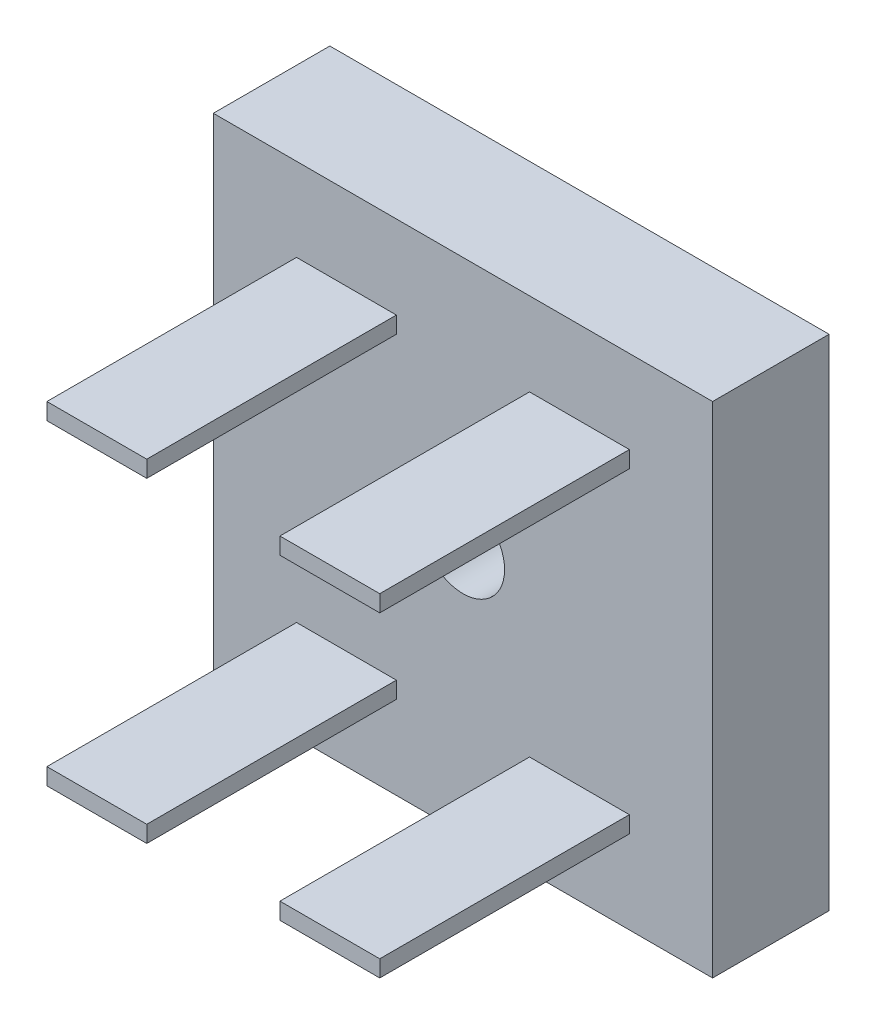
ISO-10303-21;
HEADER;
FILE_DESCRIPTION(('STEP AP214'),'2;1');
FILE_NAME('part.step','',(''),(''),'','','');
FILE_SCHEMA(('AUTOMOTIVE_DESIGN { 1 0 10303 214 1 1 1 1 }'));
ENDSEC;
DATA;
#1=APPLICATION_CONTEXT('core data for automotive mechanical design processes');
#2=APPLICATION_PROTOCOL_DEFINITION('international standard','automotive_design',2000,#1);
#3=PRODUCT_CONTEXT('',#1,'mechanical');
#4=PRODUCT('Part','Part','',(#3));
#5=PRODUCT_RELATED_PRODUCT_CATEGORY('part','',(#4));
#6=PRODUCT_DEFINITION_FORMATION('','',#4);
#7=PRODUCT_DEFINITION_CONTEXT('part definition',#1,'design');
#8=PRODUCT_DEFINITION('design','',#6,#7);
#9=PRODUCT_DEFINITION_SHAPE('','',#8);
#10=(LENGTH_UNIT() NAMED_UNIT(*) SI_UNIT(.MILLI.,.METRE.));
#11=(NAMED_UNIT(*) PLANE_ANGLE_UNIT() SI_UNIT($,.RADIAN.));
#12=(NAMED_UNIT(*) SI_UNIT($,.STERADIAN.) SOLID_ANGLE_UNIT());
#13=UNCERTAINTY_MEASURE_WITH_UNIT(LENGTH_MEASURE(1.E-05),#10,'distance_accuracy_value','');
#14=(GEOMETRIC_REPRESENTATION_CONTEXT(3) GLOBAL_UNCERTAINTY_ASSIGNED_CONTEXT((#13)) GLOBAL_UNIT_ASSIGNED_CONTEXT((#10,
#11,#12)) REPRESENTATION_CONTEXT('',''));
#15=CARTESIAN_POINT('',(0.,0.,0.));
#16=DIRECTION('',(0.,0.,1.));
#17=DIRECTION('',(1.,0.,0.));
#18=AXIS2_PLACEMENT_3D('',#15,#16,#17);
#19=CARTESIAN_POINT('',(0.,0.,7.));
#20=DIRECTION('',(0.,0.,1.));
#21=DIRECTION('',(1.,0.,0.));
#22=AXIS2_PLACEMENT_3D('',#19,#20,#21);
#23=PLANE('',#22);
#24=DIRECTION('',(0.,-1.,0.));
#25=VECTOR('',#24,1.);
#26=CARTESIAN_POINT('',(-3.21995192307692,2.7172131147541,7.));
#27=LINE('',#26,#25);
#28=CARTESIAN_POINT('',(-3.21995192307692,2.7172131147541,7.));
#29=VERTEX_POINT('',#28);
#30=CARTESIAN_POINT('',(-3.21995192307692,-27.2827868852459,7.));
#31=VERTEX_POINT('',#30);
#32=EDGE_CURVE('E292',#29,#31,#27,.T.);
#33=ORIENTED_EDGE('',*,*,#32,.T.);
#34=DIRECTION('',(1.,0.,0.));
#35=VECTOR('',#34,1.);
#36=CARTESIAN_POINT('',(-3.21995192307692,-27.2827868852459,7.));
#37=LINE('',#36,#35);
#38=CARTESIAN_POINT('',(26.7800480769231,-27.2827868852459,7.));
#39=VERTEX_POINT('',#38);
#40=EDGE_CURVE('E295',#31,#39,#37,.T.);
#41=ORIENTED_EDGE('',*,*,#40,.T.);
#42=DIRECTION('',(0.,1.,0.));
#43=VECTOR('',#42,1.);
#44=CARTESIAN_POINT('',(26.7800480769231,2.7172131147541,7.));
#45=LINE('',#44,#43);
#46=CARTESIAN_POINT('',(26.7800480769231,2.7172131147541,7.));
#47=VERTEX_POINT('',#46);
#48=EDGE_CURVE('E298',#39,#47,#45,.T.);
#49=ORIENTED_EDGE('',*,*,#48,.T.);
#50=DIRECTION('',(-1.,0.,0.));
#51=VECTOR('',#50,1.);
#52=CARTESIAN_POINT('',(-3.21995192307692,2.7172131147541,7.));
#53=LINE('',#52,#51);
#54=EDGE_CURVE('E300',#47,#29,#53,.T.);
#55=ORIENTED_EDGE('',*,*,#54,.T.);
#56=EDGE_LOOP('',(#33,#41,#49,#55));
#57=FACE_BOUND('',#56,.T.);
#58=CARTESIAN_POINT('',(11.7800480769231,-12.2827868852459,7.));
#59=DIRECTION('',(0.,0.,1.));
#60=DIRECTION('',(1.,0.,0.));
#61=AXIS2_PLACEMENT_3D('',#58,#59,#60);
#62=CIRCLE('',#61,2.5);
#63=CARTESIAN_POINT('',(14.2800480769231,-12.2827868852459,7.));
#64=VERTEX_POINT('',#63);
#65=EDGE_CURVE('E286',#64,#64,#62,.T.);
#66=ORIENTED_EDGE('',*,*,#65,.F.);
#67=EDGE_LOOP('',(#66));
#68=FACE_BOUND('',#67,.T.);
#69=DIRECTION('',(1.,0.,0.));
#70=VECTOR('',#69,1.);
#71=CARTESIAN_POINT('',(1.78004807692308,-3.2827868852459,7.));
#72=LINE('',#71,#70);
#73=CARTESIAN_POINT('',(1.78004807692308,-3.2827868852459,7.));
#74=VERTEX_POINT('',#73);
#75=CARTESIAN_POINT('',(7.78004807692308,-3.2827868852459,7.));
#76=VERTEX_POINT('',#75);
#77=EDGE_CURVE('E270',#74,#76,#72,.T.);
#78=ORIENTED_EDGE('',*,*,#77,.F.);
#79=DIRECTION('',(0.,-1.,0.));
#80=VECTOR('',#79,1.);
#81=CARTESIAN_POINT('',(1.78004807692308,-2.2827868852459,7.));
#82=LINE('',#81,#80);
#83=CARTESIAN_POINT('',(1.78004807692308,-2.2827868852459,7.));
#84=VERTEX_POINT('',#83);
#85=EDGE_CURVE('E256',#84,#74,#82,.T.);
#86=ORIENTED_EDGE('',*,*,#85,.F.);
#87=DIRECTION('',(-1.,0.,0.));
#88=VECTOR('',#87,1.);
#89=CARTESIAN_POINT('',(1.78004807692308,-2.2827868852459,7.));
#90=LINE('',#89,#88);
#91=CARTESIAN_POINT('',(7.78004807692308,-2.2827868852459,7.));
#92=VERTEX_POINT('',#91);
#93=EDGE_CURVE('E261',#92,#84,#90,.T.);
#94=ORIENTED_EDGE('',*,*,#93,.F.);
#95=DIRECTION('',(0.,1.,0.));
#96=VECTOR('',#95,1.);
#97=CARTESIAN_POINT('',(7.78004807692308,-2.2827868852459,7.));
#98=LINE('',#97,#96);
#99=EDGE_CURVE('E272',#76,#92,#98,.T.);
#100=ORIENTED_EDGE('',*,*,#99,.F.);
#101=EDGE_LOOP('',(#78,#86,#94,#100));
#102=FACE_BOUND('',#101,.T.);
#103=DIRECTION('',(1.,0.,0.));
#104=VECTOR('',#103,1.);
#105=CARTESIAN_POINT('',(15.7800480769231,-3.2827868852459,7.));
#106=LINE('',#105,#104);
#107=CARTESIAN_POINT('',(15.7800480769231,-3.2827868852459,7.));
#108=VERTEX_POINT('',#107);
#109=CARTESIAN_POINT('',(21.7800480769231,-3.2827868852459,7.));
#110=VERTEX_POINT('',#109);
#111=EDGE_CURVE('E241',#108,#110,#106,.T.);
#112=ORIENTED_EDGE('',*,*,#111,.F.);
#113=DIRECTION('',(0.,-1.,0.));
#114=VECTOR('',#113,1.);
#115=CARTESIAN_POINT('',(15.7800480769231,-2.2827868852459,7.));
#116=LINE('',#115,#114);
#117=CARTESIAN_POINT('',(15.7800480769231,-2.2827868852459,7.));
#118=VERTEX_POINT('',#117);
#119=EDGE_CURVE('E227',#118,#108,#116,.T.);
#120=ORIENTED_EDGE('',*,*,#119,.F.);
#121=DIRECTION('',(-1.,0.,0.));
#122=VECTOR('',#121,1.);
#123=CARTESIAN_POINT('',(15.7800480769231,-2.2827868852459,7.));
#124=LINE('',#123,#122);
#125=CARTESIAN_POINT('',(21.7800480769231,-2.2827868852459,7.));
#126=VERTEX_POINT('',#125);
#127=EDGE_CURVE('E232',#126,#118,#124,.T.);
#128=ORIENTED_EDGE('',*,*,#127,.F.);
#129=DIRECTION('',(0.,1.,0.));
#130=VECTOR('',#129,1.);
#131=CARTESIAN_POINT('',(21.7800480769231,-2.2827868852459,7.));
#132=LINE('',#131,#130);
#133=EDGE_CURVE('E243',#110,#126,#132,.T.);
#134=ORIENTED_EDGE('',*,*,#133,.F.);
#135=EDGE_LOOP('',(#112,#120,#128,#134));
#136=FACE_BOUND('',#135,.T.);
#137=DIRECTION('',(1.,0.,0.));
#138=VECTOR('',#137,1.);
#139=CARTESIAN_POINT('',(1.78004807692308,-22.2827868852459,7.));
#140=LINE('',#139,#138);
#141=CARTESIAN_POINT('',(1.78004807692308,-22.2827868852459,7.));
#142=VERTEX_POINT('',#141);
#143=CARTESIAN_POINT('',(7.78004807692308,-22.2827868852459,7.));
#144=VERTEX_POINT('',#143);
#145=EDGE_CURVE('E199',#142,#144,#140,.T.);
#146=ORIENTED_EDGE('',*,*,#145,.F.);
#147=DIRECTION('',(0.,-1.,0.));
#148=VECTOR('',#147,1.);
#149=CARTESIAN_POINT('',(1.78004807692308,-21.2827868852459,7.));
#150=LINE('',#149,#148);
#151=CARTESIAN_POINT('',(1.78004807692308,-21.2827868852459,7.));
#152=VERTEX_POINT('',#151);
#153=EDGE_CURVE('E196',#152,#142,#150,.T.);
#154=ORIENTED_EDGE('',*,*,#153,.F.);
#155=DIRECTION('',(-1.,0.,0.));
#156=VECTOR('',#155,1.);
#157=CARTESIAN_POINT('',(1.78004807692308,-21.2827868852459,7.));
#158=LINE('',#157,#156);
#159=CARTESIAN_POINT('',(7.78004807692308,-21.2827868852459,7.));
#160=VERTEX_POINT('',#159);
#161=EDGE_CURVE('E208',#160,#152,#158,.T.);
#162=ORIENTED_EDGE('',*,*,#161,.F.);
#163=DIRECTION('',(0.,1.,0.));
#164=VECTOR('',#163,1.);
#165=CARTESIAN_POINT('',(7.78004807692308,-21.2827868852459,7.));
#166=LINE('',#165,#164);
#167=EDGE_CURVE('E216',#144,#160,#166,.T.);
#168=ORIENTED_EDGE('',*,*,#167,.F.);
#169=EDGE_LOOP('',(#146,#154,#162,#168));
#170=FACE_BOUND('',#169,.T.);
#171=DIRECTION('',(1.,0.,0.));
#172=VECTOR('',#171,1.);
#173=CARTESIAN_POINT('',(15.7800480769231,-22.2827868852459,7.));
#174=LINE('',#173,#172);
#175=CARTESIAN_POINT('',(15.7800480769231,-22.2827868852459,7.));
#176=VERTEX_POINT('',#175);
#177=CARTESIAN_POINT('',(21.7800480769231,-22.2827868852459,7.));
#178=VERTEX_POINT('',#177);
#179=EDGE_CURVE('E381',#176,#178,#174,.T.);
#180=ORIENTED_EDGE('',*,*,#179,.F.);
#181=DIRECTION('',(0.,-1.,0.));
#182=VECTOR('',#181,1.);
#183=CARTESIAN_POINT('',(15.7800480769231,-21.2827868852459,7.));
#184=LINE('',#183,#182);
#185=CARTESIAN_POINT('',(15.7800480769231,-21.2827868852459,7.));
#186=VERTEX_POINT('',#185);
#187=EDGE_CURVE('E194',#186,#176,#184,.T.);
#188=ORIENTED_EDGE('',*,*,#187,.F.);
#189=DIRECTION('',(-1.,0.,0.));
#190=VECTOR('',#189,1.);
#191=CARTESIAN_POINT('',(15.7800480769231,-21.2827868852459,7.));
#192=LINE('',#191,#190);
#193=CARTESIAN_POINT('',(21.7800480769231,-21.2827868852459,7.));
#194=VERTEX_POINT('',#193);
#195=EDGE_CURVE('E190',#194,#186,#192,.T.);
#196=ORIENTED_EDGE('',*,*,#195,.F.);
#197=DIRECTION('',(0.,1.,0.));
#198=VECTOR('',#197,1.);
#199=CARTESIAN_POINT('',(21.7800480769231,-21.2827868852459,7.));
#200=LINE('',#199,#198);
#201=EDGE_CURVE('E383',#178,#194,#200,.T.);
#202=ORIENTED_EDGE('',*,*,#201,.F.);
#203=EDGE_LOOP('',(#180,#188,#196,#202));
#204=FACE_BOUND('',#203,.T.);
#205=ADVANCED_FACE('F33',(#57,#68,#102,#136,#170,#204),#23,.T.);
#206=CARTESIAN_POINT('',(0.,0.,0.));
#207=DIRECTION('',(0.,0.,1.));
#208=DIRECTION('',(1.,0.,0.));
#209=AXIS2_PLACEMENT_3D('',#206,#207,#208);
#210=PLANE('',#209);
#211=DIRECTION('',(0.,-1.,0.));
#212=VECTOR('',#211,1.);
#213=CARTESIAN_POINT('',(-3.21995192307692,2.7172131147541,0.));
#214=LINE('',#213,#212);
#215=CARTESIAN_POINT('',(-3.21995192307692,2.7172131147541,0.));
#216=VERTEX_POINT('',#215);
#217=CARTESIAN_POINT('',(-3.21995192307692,-27.2827868852459,0.));
#218=VERTEX_POINT('',#217);
#219=EDGE_CURVE('E289',#216,#218,#214,.T.);
#220=ORIENTED_EDGE('',*,*,#219,.F.);
#221=DIRECTION('',(-1.,0.,0.));
#222=VECTOR('',#221,1.);
#223=CARTESIAN_POINT('',(-3.21995192307692,2.7172131147541,0.));
#224=LINE('',#223,#222);
#225=CARTESIAN_POINT('',(26.7800480769231,2.7172131147541,0.));
#226=VERTEX_POINT('',#225);
#227=EDGE_CURVE('E296',#226,#216,#224,.T.);
#228=ORIENTED_EDGE('',*,*,#227,.F.);
#229=DIRECTION('',(0.,1.,0.));
#230=VECTOR('',#229,1.);
#231=CARTESIAN_POINT('',(26.7800480769231,2.7172131147541,0.));
#232=LINE('',#231,#230);
#233=CARTESIAN_POINT('',(26.7800480769231,-27.2827868852459,0.));
#234=VERTEX_POINT('',#233);
#235=EDGE_CURVE('E307',#234,#226,#232,.T.);
#236=ORIENTED_EDGE('',*,*,#235,.F.);
#237=DIRECTION('',(1.,0.,0.));
#238=VECTOR('',#237,1.);
#239=CARTESIAN_POINT('',(-3.21995192307692,-27.2827868852459,0.));
#240=LINE('',#239,#238);
#241=EDGE_CURVE('E305',#218,#234,#240,.T.);
#242=ORIENTED_EDGE('',*,*,#241,.F.);
#243=EDGE_LOOP('',(#220,#228,#236,#242));
#244=FACE_BOUND('',#243,.T.);
#245=CARTESIAN_POINT('',(11.7800480769231,-12.2827868852459,0.));
#246=DIRECTION('',(0.,0.,1.));
#247=DIRECTION('',(1.,0.,0.));
#248=AXIS2_PLACEMENT_3D('',#245,#246,#247);
#249=CIRCLE('',#248,2.5);
#250=CARTESIAN_POINT('',(14.2800480769231,-12.2827868852459,0.));
#251=VERTEX_POINT('',#250);
#252=EDGE_CURVE('E285',#251,#251,#249,.T.);
#253=ORIENTED_EDGE('',*,*,#252,.T.);
#254=EDGE_LOOP('',(#253));
#255=FACE_BOUND('',#254,.T.);
#256=ADVANCED_FACE('F325',(#244,#255),#210,.F.);
#257=CARTESIAN_POINT('',(-3.21995192307692,2.7172131147541,7.));
#258=DIRECTION('',(1.,0.,0.));
#259=DIRECTION('',(0.,1.,0.));
#260=AXIS2_PLACEMENT_3D('',#257,#258,#259);
#261=PLANE('',#260);
#262=ORIENTED_EDGE('',*,*,#219,.T.);
#263=DIRECTION('',(0.,0.,-1.));
#264=VECTOR('',#263,1.);
#265=CARTESIAN_POINT('',(-3.21995192307692,-27.2827868852459,7.));
#266=LINE('',#265,#264);
#267=EDGE_CURVE('E11',#31,#218,#266,.T.);
#268=ORIENTED_EDGE('',*,*,#267,.F.);
#269=ORIENTED_EDGE('',*,*,#32,.F.);
#270=DIRECTION('',(0.,0.,-1.));
#271=VECTOR('',#270,1.);
#272=CARTESIAN_POINT('',(-3.21995192307692,2.7172131147541,7.));
#273=LINE('',#272,#271);
#274=EDGE_CURVE('E302',#29,#216,#273,.T.);
#275=ORIENTED_EDGE('',*,*,#274,.T.);
#276=EDGE_LOOP('',(#262,#268,#269,#275));
#277=FACE_BOUND('',#276,.T.);
#278=ADVANCED_FACE('F35',(#277),#261,.F.);
#279=CARTESIAN_POINT('',(-3.21995192307692,-27.2827868852459,7.));
#280=DIRECTION('',(0.,1.,0.));
#281=DIRECTION('',(0.,0.,1.));
#282=AXIS2_PLACEMENT_3D('',#279,#280,#281);
#283=PLANE('',#282);
#284=ORIENTED_EDGE('',*,*,#241,.T.);
#285=DIRECTION('',(0.,0.,-1.));
#286=VECTOR('',#285,1.);
#287=CARTESIAN_POINT('',(26.7800480769231,-27.2827868852459,7.));
#288=LINE('',#287,#286);
#289=EDGE_CURVE('E41',#39,#234,#288,.T.);
#290=ORIENTED_EDGE('',*,*,#289,.F.);
#291=ORIENTED_EDGE('',*,*,#40,.F.);
#292=ORIENTED_EDGE('',*,*,#267,.T.);
#293=EDGE_LOOP('',(#284,#290,#291,#292));
#294=FACE_BOUND('',#293,.T.);
#295=ADVANCED_FACE('F336',(#294),#283,.F.);
#296=CARTESIAN_POINT('',(26.7800480769231,2.7172131147541,7.));
#297=DIRECTION('',(-1.,0.,0.));
#298=DIRECTION('',(0.,-1.,0.));
#299=AXIS2_PLACEMENT_3D('',#296,#297,#298);
#300=PLANE('',#299);
#301=ORIENTED_EDGE('',*,*,#235,.T.);
#302=DIRECTION('',(0.,0.,-1.));
#303=VECTOR('',#302,1.);
#304=CARTESIAN_POINT('',(26.7800480769231,2.7172131147541,7.));
#305=LINE('',#304,#303);
#306=EDGE_CURVE('E312',#47,#226,#305,.T.);
#307=ORIENTED_EDGE('',*,*,#306,.F.);
#308=ORIENTED_EDGE('',*,*,#48,.F.);
#309=ORIENTED_EDGE('',*,*,#289,.T.);
#310=EDGE_LOOP('',(#301,#307,#308,#309));
#311=FACE_BOUND('',#310,.T.);
#312=ADVANCED_FACE('F319',(#311),#300,.F.);
#313=CARTESIAN_POINT('',(-3.21995192307692,2.7172131147541,7.));
#314=DIRECTION('',(0.,-1.,0.));
#315=DIRECTION('',(0.,0.,-1.));
#316=AXIS2_PLACEMENT_3D('',#313,#314,#315);
#317=PLANE('',#316);
#318=ORIENTED_EDGE('',*,*,#227,.T.);
#319=ORIENTED_EDGE('',*,*,#274,.F.);
#320=ORIENTED_EDGE('',*,*,#54,.F.);
#321=ORIENTED_EDGE('',*,*,#306,.T.);
#322=EDGE_LOOP('',(#318,#319,#320,#321));
#323=FACE_BOUND('',#322,.T.);
#324=ADVANCED_FACE('F329',(#323),#317,.F.);
#325=CARTESIAN_POINT('',(11.7800480769231,-12.2827868852459,7.));
#326=DIRECTION('',(0.,0.,-1.));
#327=DIRECTION('',(-1.,0.,0.));
#328=AXIS2_PLACEMENT_3D('',#325,#326,#327);
#329=CYLINDRICAL_SURFACE('',#328,2.5);
#330=ORIENTED_EDGE('',*,*,#65,.T.);
#331=EDGE_LOOP('',(#330));
#332=FACE_BOUND('',#331,.T.);
#333=ORIENTED_EDGE('',*,*,#252,.F.);
#334=EDGE_LOOP('',(#333));
#335=FACE_BOUND('',#334,.T.);
#336=ADVANCED_FACE('F350',(#332,#335),#329,.F.);
#337=CARTESIAN_POINT('',(1.78004807692308,-2.2827868852459,22.));
#338=DIRECTION('',(1.,0.,0.));
#339=DIRECTION('',(0.,1.,0.));
#340=AXIS2_PLACEMENT_3D('',#337,#338,#339);
#341=PLANE('',#340);
#342=ORIENTED_EDGE('',*,*,#85,.T.);
#343=DIRECTION('',(0.,0.,-1.));
#344=VECTOR('',#343,1.);
#345=CARTESIAN_POINT('',(1.78004807692308,-3.2827868852459,22.));
#346=LINE('',#345,#344);
#347=CARTESIAN_POINT('',(1.78004807692308,-3.2827868852459,22.));
#348=VERTEX_POINT('',#347);
#349=EDGE_CURVE('E283',#348,#74,#346,.T.);
#350=ORIENTED_EDGE('',*,*,#349,.F.);
#351=DIRECTION('',(0.,-1.,0.));
#352=VECTOR('',#351,1.);
#353=CARTESIAN_POINT('',(1.78004807692308,-2.2827868852459,22.));
#354=LINE('',#353,#352);
#355=CARTESIAN_POINT('',(1.78004807692308,-2.2827868852459,22.));
#356=VERTEX_POINT('',#355);
#357=EDGE_CURVE('E257',#356,#348,#354,.T.);
#358=ORIENTED_EDGE('',*,*,#357,.F.);
#359=DIRECTION('',(0.,0.,-1.));
#360=VECTOR('',#359,1.);
#361=CARTESIAN_POINT('',(1.78004807692308,-2.2827868852459,22.));
#362=LINE('',#361,#360);
#363=EDGE_CURVE('E267',#356,#84,#362,.T.);
#364=ORIENTED_EDGE('',*,*,#363,.T.);
#365=EDGE_LOOP('',(#342,#350,#358,#364));
#366=FACE_BOUND('',#365,.T.);
#367=ADVANCED_FACE('F357',(#366),#341,.F.);
#368=CARTESIAN_POINT('',(1.78004807692308,-3.2827868852459,22.));
#369=DIRECTION('',(0.,1.,0.));
#370=DIRECTION('',(0.,0.,1.));
#371=AXIS2_PLACEMENT_3D('',#368,#369,#370);
#372=PLANE('',#371);
#373=ORIENTED_EDGE('',*,*,#77,.T.);
#374=DIRECTION('',(0.,0.,-1.));
#375=VECTOR('',#374,1.);
#376=CARTESIAN_POINT('',(7.78004807692308,-3.2827868852459,22.));
#377=LINE('',#376,#375);
#378=CARTESIAN_POINT('',(7.78004807692308,-3.2827868852459,22.));
#379=VERTEX_POINT('',#378);
#380=EDGE_CURVE('E280',#379,#76,#377,.T.);
#381=ORIENTED_EDGE('',*,*,#380,.F.);
#382=DIRECTION('',(1.,0.,0.));
#383=VECTOR('',#382,1.);
#384=CARTESIAN_POINT('',(1.78004807692308,-3.2827868852459,22.));
#385=LINE('',#384,#383);
#386=EDGE_CURVE('E260',#348,#379,#385,.T.);
#387=ORIENTED_EDGE('',*,*,#386,.F.);
#388=ORIENTED_EDGE('',*,*,#349,.T.);
#389=EDGE_LOOP('',(#373,#381,#387,#388));
#390=FACE_BOUND('',#389,.T.);
#391=ADVANCED_FACE('F362',(#390),#372,.F.);
#392=CARTESIAN_POINT('',(7.78004807692308,-2.2827868852459,22.));
#393=DIRECTION('',(-1.,0.,0.));
#394=DIRECTION('',(0.,0.,1.));
#395=AXIS2_PLACEMENT_3D('',#392,#393,#394);
#396=PLANE('',#395);
#397=ORIENTED_EDGE('',*,*,#99,.T.);
#398=DIRECTION('',(0.,0.,-1.));
#399=VECTOR('',#398,1.);
#400=CARTESIAN_POINT('',(7.78004807692308,-2.2827868852459,22.));
#401=LINE('',#400,#399);
#402=CARTESIAN_POINT('',(7.78004807692308,-2.2827868852459,22.));
#403=VERTEX_POINT('',#402);
#404=EDGE_CURVE('E278',#403,#92,#401,.T.);
#405=ORIENTED_EDGE('',*,*,#404,.F.);
#406=DIRECTION('',(0.,1.,0.));
#407=VECTOR('',#406,1.);
#408=CARTESIAN_POINT('',(7.78004807692308,-2.2827868852459,22.));
#409=LINE('',#408,#407);
#410=EDGE_CURVE('E263',#379,#403,#409,.T.);
#411=ORIENTED_EDGE('',*,*,#410,.F.);
#412=ORIENTED_EDGE('',*,*,#380,.T.);
#413=EDGE_LOOP('',(#397,#405,#411,#412));
#414=FACE_BOUND('',#413,.T.);
#415=ADVANCED_FACE('F454',(#414),#396,.F.);
#416=CARTESIAN_POINT('',(1.78004807692308,-2.2827868852459,22.));
#417=DIRECTION('',(0.,-1.,0.));
#418=DIRECTION('',(0.,0.,-1.));
#419=AXIS2_PLACEMENT_3D('',#416,#417,#418);
#420=PLANE('',#419);
#421=ORIENTED_EDGE('',*,*,#93,.T.);
#422=ORIENTED_EDGE('',*,*,#363,.F.);
#423=DIRECTION('',(-1.,0.,0.));
#424=VECTOR('',#423,1.);
#425=CARTESIAN_POINT('',(1.78004807692308,-2.2827868852459,22.));
#426=LINE('',#425,#424);
#427=EDGE_CURVE('E265',#403,#356,#426,.T.);
#428=ORIENTED_EDGE('',*,*,#427,.F.);
#429=ORIENTED_EDGE('',*,*,#404,.T.);
#430=EDGE_LOOP('',(#421,#422,#428,#429));
#431=FACE_BOUND('',#430,.T.);
#432=ADVANCED_FACE('F450',(#431),#420,.F.);
#433=CARTESIAN_POINT('',(0.,0.,22.));
#434=DIRECTION('',(0.,0.,1.));
#435=DIRECTION('',(1.,0.,0.));
#436=AXIS2_PLACEMENT_3D('',#433,#434,#435);
#437=PLANE('',#436);
#438=ORIENTED_EDGE('',*,*,#357,.T.);
#439=ORIENTED_EDGE('',*,*,#386,.T.);
#440=ORIENTED_EDGE('',*,*,#410,.T.);
#441=ORIENTED_EDGE('',*,*,#427,.T.);
#442=EDGE_LOOP('',(#438,#439,#440,#441));
#443=FACE_BOUND('',#442,.T.);
#444=ADVANCED_FACE('F446',(#443),#437,.T.);
#445=CARTESIAN_POINT('',(15.7800480769231,-2.2827868852459,22.));
#446=DIRECTION('',(1.,0.,0.));
#447=DIRECTION('',(0.,0.,-1.));
#448=AXIS2_PLACEMENT_3D('',#445,#446,#447);
#449=PLANE('',#448);
#450=ORIENTED_EDGE('',*,*,#119,.T.);
#451=DIRECTION('',(0.,0.,-1.));
#452=VECTOR('',#451,1.);
#453=CARTESIAN_POINT('',(15.7800480769231,-3.2827868852459,22.));
#454=LINE('',#453,#452);
#455=CARTESIAN_POINT('',(15.7800480769231,-3.2827868852459,22.));
#456=VERTEX_POINT('',#455);
#457=EDGE_CURVE('E254',#456,#108,#454,.T.);
#458=ORIENTED_EDGE('',*,*,#457,.F.);
#459=DIRECTION('',(0.,-1.,0.));
#460=VECTOR('',#459,1.);
#461=CARTESIAN_POINT('',(15.7800480769231,-2.2827868852459,22.));
#462=LINE('',#461,#460);
#463=CARTESIAN_POINT('',(15.7800480769231,-2.2827868852459,22.));
#464=VERTEX_POINT('',#463);
#465=EDGE_CURVE('E228',#464,#456,#462,.T.);
#466=ORIENTED_EDGE('',*,*,#465,.F.);
#467=DIRECTION('',(0.,0.,-1.));
#468=VECTOR('',#467,1.);
#469=CARTESIAN_POINT('',(15.7800480769231,-2.2827868852459,22.));
#470=LINE('',#469,#468);
#471=EDGE_CURVE('E238',#464,#118,#470,.T.);
#472=ORIENTED_EDGE('',*,*,#471,.T.);
#473=EDGE_LOOP('',(#450,#458,#466,#472));
#474=FACE_BOUND('',#473,.T.);
#475=ADVANCED_FACE('F442',(#474),#449,.F.);
#476=CARTESIAN_POINT('',(15.7800480769231,-3.2827868852459,22.));
#477=DIRECTION('',(0.,1.,0.));
#478=DIRECTION('',(0.,0.,1.));
#479=AXIS2_PLACEMENT_3D('',#476,#477,#478);
#480=PLANE('',#479);
#481=ORIENTED_EDGE('',*,*,#111,.T.);
#482=DIRECTION('',(0.,0.,-1.));
#483=VECTOR('',#482,1.);
#484=CARTESIAN_POINT('',(21.7800480769231,-3.2827868852459,22.));
#485=LINE('',#484,#483);
#486=CARTESIAN_POINT('',(21.7800480769231,-3.2827868852459,22.));
#487=VERTEX_POINT('',#486);
#488=EDGE_CURVE('E251',#487,#110,#485,.T.);
#489=ORIENTED_EDGE('',*,*,#488,.F.);
#490=DIRECTION('',(1.,0.,0.));
#491=VECTOR('',#490,1.);
#492=CARTESIAN_POINT('',(15.7800480769231,-3.2827868852459,22.));
#493=LINE('',#492,#491);
#494=EDGE_CURVE('E231',#456,#487,#493,.T.);
#495=ORIENTED_EDGE('',*,*,#494,.F.);
#496=ORIENTED_EDGE('',*,*,#457,.T.);
#497=EDGE_LOOP('',(#481,#489,#495,#496));
#498=FACE_BOUND('',#497,.T.);
#499=ADVANCED_FACE('F438',(#498),#480,.F.);
#500=CARTESIAN_POINT('',(21.7800480769231,-2.2827868852459,22.));
#501=DIRECTION('',(-1.,0.,0.));
#502=DIRECTION('',(0.,0.,1.));
#503=AXIS2_PLACEMENT_3D('',#500,#501,#502);
#504=PLANE('',#503);
#505=ORIENTED_EDGE('',*,*,#133,.T.);
#506=DIRECTION('',(0.,0.,-1.));
#507=VECTOR('',#506,1.);
#508=CARTESIAN_POINT('',(21.7800480769231,-2.2827868852459,22.));
#509=LINE('',#508,#507);
#510=CARTESIAN_POINT('',(21.7800480769231,-2.2827868852459,22.));
#511=VERTEX_POINT('',#510);
#512=EDGE_CURVE('E249',#511,#126,#509,.T.);
#513=ORIENTED_EDGE('',*,*,#512,.F.);
#514=DIRECTION('',(0.,1.,0.));
#515=VECTOR('',#514,1.);
#516=CARTESIAN_POINT('',(21.7800480769231,-2.2827868852459,22.));
#517=LINE('',#516,#515);
#518=EDGE_CURVE('E234',#487,#511,#517,.T.);
#519=ORIENTED_EDGE('',*,*,#518,.F.);
#520=ORIENTED_EDGE('',*,*,#488,.T.);
#521=EDGE_LOOP('',(#505,#513,#519,#520));
#522=FACE_BOUND('',#521,.T.);
#523=ADVANCED_FACE('F434',(#522),#504,.F.);
#524=CARTESIAN_POINT('',(15.7800480769231,-2.2827868852459,22.));
#525=DIRECTION('',(0.,-1.,0.));
#526=DIRECTION('',(0.,0.,-1.));
#527=AXIS2_PLACEMENT_3D('',#524,#525,#526);
#528=PLANE('',#527);
#529=ORIENTED_EDGE('',*,*,#127,.T.);
#530=ORIENTED_EDGE('',*,*,#471,.F.);
#531=DIRECTION('',(-1.,0.,0.));
#532=VECTOR('',#531,1.);
#533=CARTESIAN_POINT('',(15.7800480769231,-2.2827868852459,22.));
#534=LINE('',#533,#532);
#535=EDGE_CURVE('E236',#511,#464,#534,.T.);
#536=ORIENTED_EDGE('',*,*,#535,.F.);
#537=ORIENTED_EDGE('',*,*,#512,.T.);
#538=EDGE_LOOP('',(#529,#530,#536,#537));
#539=FACE_BOUND('',#538,.T.);
#540=ADVANCED_FACE('F430',(#539),#528,.F.);
#541=CARTESIAN_POINT('',(0.,0.,22.));
#542=DIRECTION('',(0.,0.,1.));
#543=DIRECTION('',(1.,0.,0.));
#544=AXIS2_PLACEMENT_3D('',#541,#542,#543);
#545=PLANE('',#544);
#546=ORIENTED_EDGE('',*,*,#465,.T.);
#547=ORIENTED_EDGE('',*,*,#494,.T.);
#548=ORIENTED_EDGE('',*,*,#518,.T.);
#549=ORIENTED_EDGE('',*,*,#535,.T.);
#550=EDGE_LOOP('',(#546,#547,#548,#549));
#551=FACE_BOUND('',#550,.T.);
#552=ADVANCED_FACE('F426',(#551),#545,.T.);
#553=CARTESIAN_POINT('',(1.78004807692308,-21.2827868852459,22.));
#554=DIRECTION('',(1.,0.,0.));
#555=DIRECTION('',(0.,1.,0.));
#556=AXIS2_PLACEMENT_3D('',#553,#554,#555);
#557=PLANE('',#556);
#558=ORIENTED_EDGE('',*,*,#153,.T.);
#559=DIRECTION('',(0.,0.,-1.));
#560=VECTOR('',#559,1.);
#561=CARTESIAN_POINT('',(1.78004807692308,-22.2827868852459,22.));
#562=LINE('',#561,#560);
#563=CARTESIAN_POINT('',(1.78004807692308,-22.2827868852459,22.));
#564=VERTEX_POINT('',#563);
#565=EDGE_CURVE('E225',#564,#142,#562,.T.);
#566=ORIENTED_EDGE('',*,*,#565,.F.);
#567=DIRECTION('',(0.,-1.,0.));
#568=VECTOR('',#567,1.);
#569=CARTESIAN_POINT('',(1.78004807692308,-21.2827868852459,22.));
#570=LINE('',#569,#568);
#571=CARTESIAN_POINT('',(1.78004807692308,-21.2827868852459,22.));
#572=VERTEX_POINT('',#571);
#573=EDGE_CURVE('E204',#572,#564,#570,.T.);
#574=ORIENTED_EDGE('',*,*,#573,.F.);
#575=DIRECTION('',(0.,0.,-1.));
#576=VECTOR('',#575,1.);
#577=CARTESIAN_POINT('',(1.78004807692308,-21.2827868852459,22.));
#578=LINE('',#577,#576);
#579=EDGE_CURVE('E213',#572,#152,#578,.T.);
#580=ORIENTED_EDGE('',*,*,#579,.T.);
#581=EDGE_LOOP('',(#558,#566,#574,#580));
#582=FACE_BOUND('',#581,.T.);
#583=ADVANCED_FACE('F422',(#582),#557,.F.);
#584=CARTESIAN_POINT('',(1.78004807692308,-22.2827868852459,22.));
#585=DIRECTION('',(0.,1.,0.));
#586=DIRECTION('',(0.,0.,1.));
#587=AXIS2_PLACEMENT_3D('',#584,#585,#586);
#588=PLANE('',#587);
#589=ORIENTED_EDGE('',*,*,#145,.T.);
#590=DIRECTION('',(0.,0.,-1.));
#591=VECTOR('',#590,1.);
#592=CARTESIAN_POINT('',(7.78004807692308,-22.2827868852459,22.));
#593=LINE('',#592,#591);
#594=CARTESIAN_POINT('',(7.78004807692308,-22.2827868852459,22.));
#595=VERTEX_POINT('',#594);
#596=EDGE_CURVE('E222',#595,#144,#593,.T.);
#597=ORIENTED_EDGE('',*,*,#596,.F.);
#598=DIRECTION('',(1.,0.,0.));
#599=VECTOR('',#598,1.);
#600=CARTESIAN_POINT('',(1.78004807692308,-22.2827868852459,22.));
#601=LINE('',#600,#599);
#602=EDGE_CURVE('E207',#564,#595,#601,.T.);
#603=ORIENTED_EDGE('',*,*,#602,.F.);
#604=ORIENTED_EDGE('',*,*,#565,.T.);
#605=EDGE_LOOP('',(#589,#597,#603,#604));
#606=FACE_BOUND('',#605,.T.);
#607=ADVANCED_FACE('F418',(#606),#588,.F.);
#608=CARTESIAN_POINT('',(7.78004807692308,-21.2827868852459,22.));
#609=DIRECTION('',(-1.,0.,0.));
#610=DIRECTION('',(0.,0.,1.));
#611=AXIS2_PLACEMENT_3D('',#608,#609,#610);
#612=PLANE('',#611);
#613=ORIENTED_EDGE('',*,*,#167,.T.);
#614=DIRECTION('',(0.,0.,-1.));
#615=VECTOR('',#614,1.);
#616=CARTESIAN_POINT('',(7.78004807692308,-21.2827868852459,22.));
#617=LINE('',#616,#615);
#618=CARTESIAN_POINT('',(7.78004807692308,-21.2827868852459,22.));
#619=VERTEX_POINT('',#618);
#620=EDGE_CURVE('E56',#619,#160,#617,.T.);
#621=ORIENTED_EDGE('',*,*,#620,.F.);
#622=DIRECTION('',(0.,1.,0.));
#623=VECTOR('',#622,1.);
#624=CARTESIAN_POINT('',(7.78004807692308,-21.2827868852459,22.));
#625=LINE('',#624,#623);
#626=EDGE_CURVE('E210',#595,#619,#625,.T.);
#627=ORIENTED_EDGE('',*,*,#626,.F.);
#628=ORIENTED_EDGE('',*,*,#596,.T.);
#629=EDGE_LOOP('',(#613,#621,#627,#628));
#630=FACE_BOUND('',#629,.T.);
#631=ADVANCED_FACE('F415',(#630),#612,.F.);
#632=CARTESIAN_POINT('',(1.78004807692308,-21.2827868852459,22.));
#633=DIRECTION('',(0.,-1.,0.));
#634=DIRECTION('',(0.,0.,-1.));
#635=AXIS2_PLACEMENT_3D('',#632,#633,#634);
#636=PLANE('',#635);
#637=ORIENTED_EDGE('',*,*,#161,.T.);
#638=ORIENTED_EDGE('',*,*,#579,.F.);
#639=DIRECTION('',(-1.,0.,0.));
#640=VECTOR('',#639,1.);
#641=CARTESIAN_POINT('',(1.78004807692308,-21.2827868852459,22.));
#642=LINE('',#641,#640);
#643=EDGE_CURVE('E212',#619,#572,#642,.T.);
#644=ORIENTED_EDGE('',*,*,#643,.F.);
#645=ORIENTED_EDGE('',*,*,#620,.T.);
#646=EDGE_LOOP('',(#637,#638,#644,#645));
#647=FACE_BOUND('',#646,.T.);
#648=ADVANCED_FACE('F411',(#647),#636,.F.);
#649=CARTESIAN_POINT('',(0.,0.,22.));
#650=DIRECTION('',(0.,0.,1.));
#651=DIRECTION('',(1.,0.,0.));
#652=AXIS2_PLACEMENT_3D('',#649,#650,#651);
#653=PLANE('',#652);
#654=ORIENTED_EDGE('',*,*,#573,.T.);
#655=ORIENTED_EDGE('',*,*,#602,.T.);
#656=ORIENTED_EDGE('',*,*,#626,.T.);
#657=ORIENTED_EDGE('',*,*,#643,.T.);
#658=EDGE_LOOP('',(#654,#655,#656,#657));
#659=FACE_BOUND('',#658,.T.);
#660=ADVANCED_FACE('F408',(#659),#653,.T.);
#661=CARTESIAN_POINT('',(15.7800480769231,-21.2827868852459,22.));
#662=DIRECTION('',(1.,0.,0.));
#663=DIRECTION('',(0.,0.,-1.));
#664=AXIS2_PLACEMENT_3D('',#661,#662,#663);
#665=PLANE('',#664);
#666=ORIENTED_EDGE('',*,*,#187,.T.);
#667=DIRECTION('',(0.,0.,-1.));
#668=VECTOR('',#667,1.);
#669=CARTESIAN_POINT('',(15.7800480769231,-22.2827868852459,22.));
#670=LINE('',#669,#668);
#671=CARTESIAN_POINT('',(15.7800480769231,-22.2827868852459,22.));
#672=VERTEX_POINT('',#671);
#673=EDGE_CURVE('E175',#672,#176,#670,.T.);
#674=ORIENTED_EDGE('',*,*,#673,.F.);
#675=DIRECTION('',(0.,-1.,0.));
#676=VECTOR('',#675,1.);
#677=CARTESIAN_POINT('',(15.7800480769231,-21.2827868852459,22.));
#678=LINE('',#677,#676);
#679=CARTESIAN_POINT('',(15.7800480769231,-21.2827868852459,22.));
#680=VERTEX_POINT('',#679);
#681=EDGE_CURVE('E182',#680,#672,#678,.T.);
#682=ORIENTED_EDGE('',*,*,#681,.F.);
#683=DIRECTION('',(0.,0.,-1.));
#684=VECTOR('',#683,1.);
#685=CARTESIAN_POINT('',(15.7800480769231,-21.2827868852459,22.));
#686=LINE('',#685,#684);
#687=EDGE_CURVE('E390',#680,#186,#686,.T.);
#688=ORIENTED_EDGE('',*,*,#687,.T.);
#689=EDGE_LOOP('',(#666,#674,#682,#688));
#690=FACE_BOUND('',#689,.T.);
#691=ADVANCED_FACE('F192',(#690),#665,.F.);
#692=CARTESIAN_POINT('',(15.7800480769231,-22.2827868852459,22.));
#693=DIRECTION('',(0.,1.,0.));
#694=DIRECTION('',(0.,0.,1.));
#695=AXIS2_PLACEMENT_3D('',#692,#693,#694);
#696=PLANE('',#695);
#697=ORIENTED_EDGE('',*,*,#179,.T.);
#698=DIRECTION('',(0.,0.,-1.));
#699=VECTOR('',#698,1.);
#700=CARTESIAN_POINT('',(21.7800480769231,-22.2827868852459,22.));
#701=LINE('',#700,#699);
#702=CARTESIAN_POINT('',(21.7800480769231,-22.2827868852459,22.));
#703=VERTEX_POINT('',#702);
#704=EDGE_CURVE('E178',#703,#178,#701,.T.);
#705=ORIENTED_EDGE('',*,*,#704,.F.);
#706=DIRECTION('',(1.,0.,0.));
#707=VECTOR('',#706,1.);
#708=CARTESIAN_POINT('',(15.7800480769231,-22.2827868852459,22.));
#709=LINE('',#708,#707);
#710=EDGE_CURVE('E171',#672,#703,#709,.T.);
#711=ORIENTED_EDGE('',*,*,#710,.F.);
#712=ORIENTED_EDGE('',*,*,#673,.T.);
#713=EDGE_LOOP('',(#697,#705,#711,#712));
#714=FACE_BOUND('',#713,.T.);
#715=ADVANCED_FACE('F173',(#714),#696,.F.);
#716=CARTESIAN_POINT('',(21.7800480769231,-21.2827868852459,22.));
#717=DIRECTION('',(-1.,0.,0.));
#718=DIRECTION('',(0.,0.,1.));
#719=AXIS2_PLACEMENT_3D('',#716,#717,#718);
#720=PLANE('',#719);
#721=ORIENTED_EDGE('',*,*,#201,.T.);
#722=DIRECTION('',(0.,0.,-1.));
#723=VECTOR('',#722,1.);
#724=CARTESIAN_POINT('',(21.7800480769231,-21.2827868852459,22.));
#725=LINE('',#724,#723);
#726=CARTESIAN_POINT('',(21.7800480769231,-21.2827868852459,22.));
#727=VERTEX_POINT('',#726);
#728=EDGE_CURVE('E48',#727,#194,#725,.T.);
#729=ORIENTED_EDGE('',*,*,#728,.F.);
#730=DIRECTION('',(0.,1.,0.));
#731=VECTOR('',#730,1.);
#732=CARTESIAN_POINT('',(21.7800480769231,-21.2827868852459,22.));
#733=LINE('',#732,#731);
#734=EDGE_CURVE('E181',#703,#727,#733,.T.);
#735=ORIENTED_EDGE('',*,*,#734,.F.);
#736=ORIENTED_EDGE('',*,*,#704,.T.);
#737=EDGE_LOOP('',(#721,#729,#735,#736));
#738=FACE_BOUND('',#737,.T.);
#739=ADVANCED_FACE('F393',(#738),#720,.F.);
#740=CARTESIAN_POINT('',(15.7800480769231,-21.2827868852459,22.));
#741=DIRECTION('',(0.,-1.,0.));
#742=DIRECTION('',(0.,0.,-1.));
#743=AXIS2_PLACEMENT_3D('',#740,#741,#742);
#744=PLANE('',#743);
#745=ORIENTED_EDGE('',*,*,#195,.T.);
#746=ORIENTED_EDGE('',*,*,#687,.F.);
#747=DIRECTION('',(-1.,0.,0.));
#748=VECTOR('',#747,1.);
#749=CARTESIAN_POINT('',(15.7800480769231,-21.2827868852459,22.));
#750=LINE('',#749,#748);
#751=EDGE_CURVE('E186',#727,#680,#750,.T.);
#752=ORIENTED_EDGE('',*,*,#751,.F.);
#753=ORIENTED_EDGE('',*,*,#728,.T.);
#754=EDGE_LOOP('',(#745,#746,#752,#753));
#755=FACE_BOUND('',#754,.T.);
#756=ADVANCED_FACE('F394',(#755),#744,.F.);
#757=CARTESIAN_POINT('',(0.,0.,22.));
#758=DIRECTION('',(0.,0.,1.));
#759=DIRECTION('',(1.,0.,0.));
#760=AXIS2_PLACEMENT_3D('',#757,#758,#759);
#761=PLANE('',#760);
#762=ORIENTED_EDGE('',*,*,#681,.T.);
#763=ORIENTED_EDGE('',*,*,#710,.T.);
#764=ORIENTED_EDGE('',*,*,#734,.T.);
#765=ORIENTED_EDGE('',*,*,#751,.T.);
#766=EDGE_LOOP('',(#762,#763,#764,#765));
#767=FACE_BOUND('',#766,.T.);
#768=ADVANCED_FACE('F185',(#767),#761,.T.);
#769=CLOSED_SHELL('',(#205,#256,#278,#295,#312,#324,#336,#367,#391,#415,#432,#444,#475,#499,
#523,#540,#552,#583,#607,#631,#648,#660,#691,#715,#739,#756,#768));
#770=MANIFOLD_SOLID_BREP('B2',#769);
#771=ADVANCED_BREP_SHAPE_REPRESENTATION('',(#18,#770),#14);
#772=SHAPE_DEFINITION_REPRESENTATION(#9,#771);
ENDSEC;
END-ISO-10303-21;
